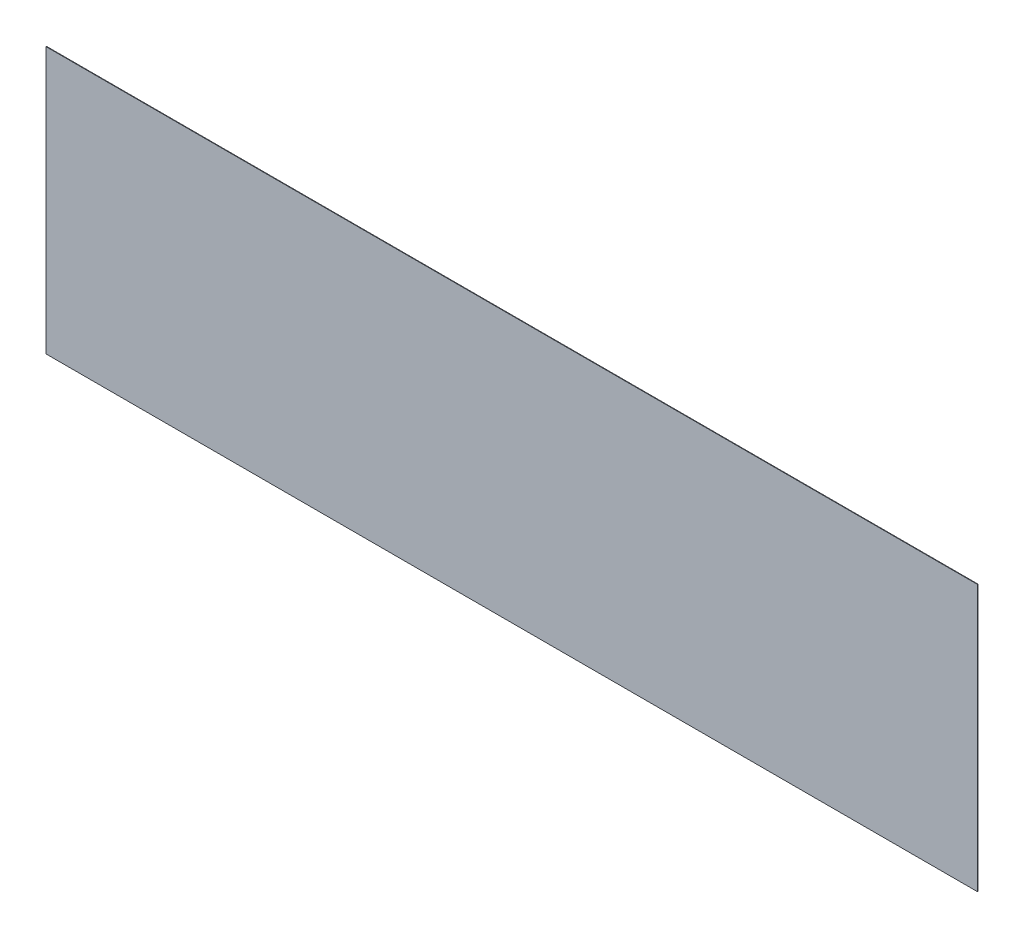
ISO-10303-21;
HEADER;
FILE_DESCRIPTION(('STEP AP214'),'2;1');
FILE_NAME('part.step','',(''),(''),'','','');
FILE_SCHEMA(('AUTOMOTIVE_DESIGN { 1 0 10303 214 1 1 1 1 }'));
ENDSEC;
DATA;
#1=APPLICATION_CONTEXT('core data for automotive mechanical design processes');
#2=APPLICATION_PROTOCOL_DEFINITION('international standard','automotive_design',2000,#1);
#3=PRODUCT_CONTEXT('',#1,'mechanical');
#4=PRODUCT('Part','Part','',(#3));
#5=PRODUCT_RELATED_PRODUCT_CATEGORY('part','',(#4));
#6=PRODUCT_DEFINITION_FORMATION('','',#4);
#7=PRODUCT_DEFINITION_CONTEXT('part definition',#1,'design');
#8=PRODUCT_DEFINITION('design','',#6,#7);
#9=PRODUCT_DEFINITION_SHAPE('','',#8);
#10=(LENGTH_UNIT() NAMED_UNIT(*) SI_UNIT(.MILLI.,.METRE.));
#11=(NAMED_UNIT(*) PLANE_ANGLE_UNIT() SI_UNIT($,.RADIAN.));
#12=(NAMED_UNIT(*) SI_UNIT($,.STERADIAN.) SOLID_ANGLE_UNIT());
#13=UNCERTAINTY_MEASURE_WITH_UNIT(LENGTH_MEASURE(1.E-05),#10,'distance_accuracy_value','');
#14=(GEOMETRIC_REPRESENTATION_CONTEXT(3) GLOBAL_UNCERTAINTY_ASSIGNED_CONTEXT((#13)) GLOBAL_UNIT_ASSIGNED_CONTEXT((#10,
#11,#12)) REPRESENTATION_CONTEXT('',''));
#15=CARTESIAN_POINT('',(0.,0.,0.));
#16=DIRECTION('',(0.,0.,1.));
#17=DIRECTION('',(1.,0.,0.));
#18=AXIS2_PLACEMENT_3D('',#15,#16,#17);
#19=CARTESIAN_POINT('',(-26.9715142428786,14.4302848575712,0.04));
#20=DIRECTION('',(1.,0.,0.));
#21=DIRECTION('',(0.,0.,-1.));
#22=AXIS2_PLACEMENT_3D('',#19,#20,#21);
#23=PLANE('',#22);
#24=DIRECTION('',(0.,-1.,0.));
#25=VECTOR('',#24,1.);
#26=CARTESIAN_POINT('',(-26.9715142428786,14.4302848575712,0.));
#27=LINE('',#26,#25);
#28=CARTESIAN_POINT('',(-26.9715142428786,14.4302848575712,0.));
#29=VERTEX_POINT('',#28);
#30=CARTESIAN_POINT('',(-26.9715142428786,-5.56971514242879,0.));
#31=VERTEX_POINT('',#30);
#32=EDGE_CURVE('E97',#29,#31,#27,.T.);
#33=ORIENTED_EDGE('',*,*,#32,.T.);
#34=DIRECTION('',(0.,0.,-1.));
#35=VECTOR('',#34,1.);
#36=CARTESIAN_POINT('',(-26.9715142428786,-5.56971514242879,0.04));
#37=LINE('',#36,#35);
#38=CARTESIAN_POINT('',(-26.9715142428786,-5.56971514242879,0.04));
#39=VERTEX_POINT('',#38);
#40=EDGE_CURVE('E11',#39,#31,#37,.T.);
#41=ORIENTED_EDGE('',*,*,#40,.F.);
#42=DIRECTION('',(0.,-1.,0.));
#43=VECTOR('',#42,1.);
#44=CARTESIAN_POINT('',(-26.9715142428786,14.4302848575712,0.04));
#45=LINE('',#44,#43);
#46=CARTESIAN_POINT('',(-26.9715142428786,14.4302848575712,0.04));
#47=VERTEX_POINT('',#46);
#48=EDGE_CURVE('E85',#47,#39,#45,.T.);
#49=ORIENTED_EDGE('',*,*,#48,.F.);
#50=DIRECTION('',(0.,0.,-1.));
#51=VECTOR('',#50,1.);
#52=CARTESIAN_POINT('',(-26.9715142428786,14.4302848575712,0.04));
#53=LINE('',#52,#51);
#54=EDGE_CURVE('E93',#47,#29,#53,.T.);
#55=ORIENTED_EDGE('',*,*,#54,.T.);
#56=EDGE_LOOP('',(#33,#41,#49,#55));
#57=FACE_BOUND('',#56,.T.);
#58=ADVANCED_FACE('F34',(#57),#23,.F.);
#59=CARTESIAN_POINT('',(-26.9715142428786,-5.56971514242879,0.04));
#60=DIRECTION('',(0.,1.,0.));
#61=DIRECTION('',(0.,0.,1.));
#62=AXIS2_PLACEMENT_3D('',#59,#60,#61);
#63=PLANE('',#62);
#64=DIRECTION('',(1.,0.,0.));
#65=VECTOR('',#64,1.);
#66=CARTESIAN_POINT('',(-26.9715142428786,-5.56971514242879,0.));
#67=LINE('',#66,#65);
#68=CARTESIAN_POINT('',(43.0284857571214,-5.56971514242879,0.));
#69=VERTEX_POINT('',#68);
#70=EDGE_CURVE('E89',#31,#69,#67,.T.);
#71=ORIENTED_EDGE('',*,*,#70,.T.);
#72=DIRECTION('',(0.,0.,-1.));
#73=VECTOR('',#72,1.);
#74=CARTESIAN_POINT('',(43.0284857571214,-5.56971514242879,0.04));
#75=LINE('',#74,#73);
#76=CARTESIAN_POINT('',(43.0284857571214,-5.56971514242879,0.04));
#77=VERTEX_POINT('',#76);
#78=EDGE_CURVE('E42',#77,#69,#75,.T.);
#79=ORIENTED_EDGE('',*,*,#78,.F.);
#80=DIRECTION('',(1.,0.,0.));
#81=VECTOR('',#80,1.);
#82=CARTESIAN_POINT('',(-26.9715142428786,-5.56971514242879,0.04));
#83=LINE('',#82,#81);
#84=EDGE_CURVE('E80',#39,#77,#83,.T.);
#85=ORIENTED_EDGE('',*,*,#84,.F.);
#86=ORIENTED_EDGE('',*,*,#40,.T.);
#87=EDGE_LOOP('',(#71,#79,#85,#86));
#88=FACE_BOUND('',#87,.T.);
#89=ADVANCED_FACE('F88',(#88),#63,.F.);
#90=CARTESIAN_POINT('',(43.0284857571214,14.4302848575712,0.04));
#91=DIRECTION('',(-1.,0.,0.));
#92=DIRECTION('',(0.,0.,1.));
#93=AXIS2_PLACEMENT_3D('',#90,#91,#92);
#94=PLANE('',#93);
#95=DIRECTION('',(0.,1.,0.));
#96=VECTOR('',#95,1.);
#97=CARTESIAN_POINT('',(43.0284857571214,14.4302848575712,0.));
#98=LINE('',#97,#96);
#99=CARTESIAN_POINT('',(43.0284857571214,14.4302848575712,0.));
#100=VERTEX_POINT('',#99);
#101=EDGE_CURVE('E67',#69,#100,#98,.T.);
#102=ORIENTED_EDGE('',*,*,#101,.T.);
#103=DIRECTION('',(0.,0.,-1.));
#104=VECTOR('',#103,1.);
#105=CARTESIAN_POINT('',(43.0284857571214,14.4302848575712,0.04));
#106=LINE('',#105,#104);
#107=CARTESIAN_POINT('',(43.0284857571214,14.4302848575712,0.04));
#108=VERTEX_POINT('',#107);
#109=EDGE_CURVE('E90',#108,#100,#106,.T.);
#110=ORIENTED_EDGE('',*,*,#109,.F.);
#111=DIRECTION('',(0.,1.,0.));
#112=VECTOR('',#111,1.);
#113=CARTESIAN_POINT('',(43.0284857571214,14.4302848575712,0.04));
#114=LINE('',#113,#112);
#115=EDGE_CURVE('E83',#77,#108,#114,.T.);
#116=ORIENTED_EDGE('',*,*,#115,.F.);
#117=ORIENTED_EDGE('',*,*,#78,.T.);
#118=EDGE_LOOP('',(#102,#110,#116,#117));
#119=FACE_BOUND('',#118,.T.);
#120=ADVANCED_FACE('F91',(#119),#94,.F.);
#121=CARTESIAN_POINT('',(-26.9715142428786,14.4302848575712,0.04));
#122=DIRECTION('',(0.,-1.,0.));
#123=DIRECTION('',(0.,0.,-1.));
#124=AXIS2_PLACEMENT_3D('',#121,#122,#123);
#125=PLANE('',#124);
#126=DIRECTION('',(-1.,0.,0.));
#127=VECTOR('',#126,1.);
#128=CARTESIAN_POINT('',(-26.9715142428786,14.4302848575712,0.));
#129=LINE('',#128,#127);
#130=EDGE_CURVE('E73',#100,#29,#129,.T.);
#131=ORIENTED_EDGE('',*,*,#130,.T.);
#132=ORIENTED_EDGE('',*,*,#54,.F.);
#133=DIRECTION('',(-1.,0.,0.));
#134=VECTOR('',#133,1.);
#135=CARTESIAN_POINT('',(-26.9715142428786,14.4302848575712,0.04));
#136=LINE('',#135,#134);
#137=EDGE_CURVE('E50',#108,#47,#136,.T.);
#138=ORIENTED_EDGE('',*,*,#137,.F.);
#139=ORIENTED_EDGE('',*,*,#109,.T.);
#140=EDGE_LOOP('',(#131,#132,#138,#139));
#141=FACE_BOUND('',#140,.T.);
#142=ADVANCED_FACE('F104',(#141),#125,.F.);
#143=CARTESIAN_POINT('',(0.,0.,0.04));
#144=DIRECTION('',(0.,0.,1.));
#145=DIRECTION('',(1.,0.,0.));
#146=AXIS2_PLACEMENT_3D('',#143,#144,#145);
#147=PLANE('',#146);
#148=ORIENTED_EDGE('',*,*,#48,.T.);
#149=ORIENTED_EDGE('',*,*,#84,.T.);
#150=ORIENTED_EDGE('',*,*,#115,.T.);
#151=ORIENTED_EDGE('',*,*,#137,.T.);
#152=EDGE_LOOP('',(#148,#149,#150,#151));
#153=FACE_BOUND('',#152,.T.);
#154=ADVANCED_FACE('F81',(#153),#147,.T.);
#155=CARTESIAN_POINT('',(0.,0.,0.));
#156=DIRECTION('',(0.,0.,1.));
#157=DIRECTION('',(1.,0.,0.));
#158=AXIS2_PLACEMENT_3D('',#155,#156,#157);
#159=PLANE('',#158);
#160=ORIENTED_EDGE('',*,*,#32,.F.);
#161=ORIENTED_EDGE('',*,*,#130,.F.);
#162=ORIENTED_EDGE('',*,*,#101,.F.);
#163=ORIENTED_EDGE('',*,*,#70,.F.);
#164=EDGE_LOOP('',(#160,#161,#162,#163));
#165=FACE_BOUND('',#164,.T.);
#166=ADVANCED_FACE('F107',(#165),#159,.F.);
#167=CLOSED_SHELL('',(#58,#89,#120,#142,#154,#166));
#168=MANIFOLD_SOLID_BREP('B2',#167);
#169=ADVANCED_BREP_SHAPE_REPRESENTATION('',(#18,#168),#14);
#170=SHAPE_DEFINITION_REPRESENTATION(#9,#169);
ENDSEC;
END-ISO-10303-21;
